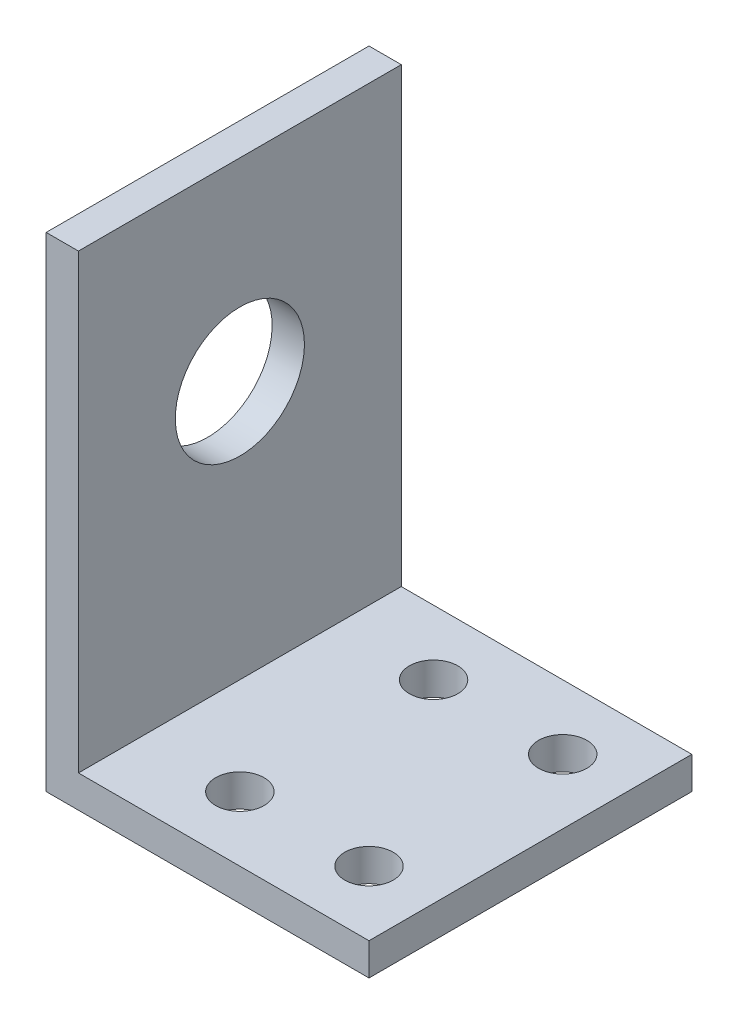
ISO-10303-21;
HEADER;
FILE_DESCRIPTION(('STEP AP214'),'2;1');
FILE_NAME('part.step','',(''),(''),'','','');
FILE_SCHEMA(('AUTOMOTIVE_DESIGN { 1 0 10303 214 1 1 1 1 }'));
ENDSEC;
DATA;
#1=APPLICATION_CONTEXT('core data for automotive mechanical design processes');
#2=APPLICATION_PROTOCOL_DEFINITION('international standard','automotive_design',2000,#1);
#3=PRODUCT_CONTEXT('',#1,'mechanical');
#4=PRODUCT('Part','Part','',(#3));
#5=PRODUCT_RELATED_PRODUCT_CATEGORY('part','',(#4));
#6=PRODUCT_DEFINITION_FORMATION('','',#4);
#7=PRODUCT_DEFINITION_CONTEXT('part definition',#1,'design');
#8=PRODUCT_DEFINITION('design','',#6,#7);
#9=PRODUCT_DEFINITION_SHAPE('','',#8);
#10=(LENGTH_UNIT() NAMED_UNIT(*) SI_UNIT(.MILLI.,.METRE.));
#11=(NAMED_UNIT(*) PLANE_ANGLE_UNIT() SI_UNIT($,.RADIAN.));
#12=(NAMED_UNIT(*) SI_UNIT($,.STERADIAN.) SOLID_ANGLE_UNIT());
#13=UNCERTAINTY_MEASURE_WITH_UNIT(LENGTH_MEASURE(1.E-05),#10,'distance_accuracy_value','');
#14=(GEOMETRIC_REPRESENTATION_CONTEXT(3) GLOBAL_UNCERTAINTY_ASSIGNED_CONTEXT((#13)) GLOBAL_UNIT_ASSIGNED_CONTEXT((#10,
#11,#12)) REPRESENTATION_CONTEXT('',''));
#15=CARTESIAN_POINT('',(0.,0.,0.));
#16=DIRECTION('',(0.,0.,1.));
#17=DIRECTION('',(1.,0.,0.));
#18=AXIS2_PLACEMENT_3D('',#15,#16,#17);
#19=CARTESIAN_POINT('',(20.,3.,20.));
#20=DIRECTION('',(-1.,0.,0.));
#21=DIRECTION('',(0.,-1.,0.));
#22=AXIS2_PLACEMENT_3D('',#19,#20,#21);
#23=PLANE('',#22);
#24=DIRECTION('',(0.,0.,-1.));
#25=VECTOR('',#24,1.);
#26=CARTESIAN_POINT('',(20.,2.,0.));
#27=LINE('',#26,#25);
#28=CARTESIAN_POINT('',(20.,2.,20.));
#29=VERTEX_POINT('',#28);
#30=CARTESIAN_POINT('',(20.,2.,0.));
#31=VERTEX_POINT('',#30);
#32=EDGE_CURVE('E176',#29,#31,#27,.T.);
#33=ORIENTED_EDGE('',*,*,#32,.F.);
#34=DIRECTION('',(0.,1.,0.));
#35=VECTOR('',#34,1.);
#36=CARTESIAN_POINT('',(20.,3.,20.));
#37=LINE('',#36,#35);
#38=CARTESIAN_POINT('',(20.,0.,20.));
#39=VERTEX_POINT('',#38);
#40=EDGE_CURVE('E116',#39,#29,#37,.T.);
#41=ORIENTED_EDGE('',*,*,#40,.F.);
#42=DIRECTION('',(0.,0.,-1.));
#43=VECTOR('',#42,1.);
#44=CARTESIAN_POINT('',(20.,0.,20.));
#45=LINE('',#44,#43);
#46=CARTESIAN_POINT('',(20.,0.,0.));
#47=VERTEX_POINT('',#46);
#48=EDGE_CURVE('E11',#39,#47,#45,.T.);
#49=ORIENTED_EDGE('',*,*,#48,.T.);
#50=DIRECTION('',(0.,1.,0.));
#51=VECTOR('',#50,1.);
#52=CARTESIAN_POINT('',(20.,3.,0.));
#53=LINE('',#52,#51);
#54=EDGE_CURVE('E92',#47,#31,#53,.T.);
#55=ORIENTED_EDGE('',*,*,#54,.T.);
#56=EDGE_LOOP('',(#33,#41,#49,#55));
#57=FACE_BOUND('',#56,.T.);
#58=ADVANCED_FACE('F40',(#57),#23,.F.);
#59=CARTESIAN_POINT('',(16.,0.,16.));
#60=DIRECTION('',(0.,1.,0.));
#61=DIRECTION('',(0.,0.,1.));
#62=AXIS2_PLACEMENT_3D('',#59,#60,#61);
#63=CYLINDRICAL_SURFACE('',#62,1.5);
#64=CARTESIAN_POINT('',(16.,0.,16.));
#65=DIRECTION('',(0.,1.,0.));
#66=DIRECTION('',(0.,0.,1.));
#67=AXIS2_PLACEMENT_3D('',#64,#65,#66);
#68=CIRCLE('',#67,1.5);
#69=CARTESIAN_POINT('',(16.,0.,17.5));
#70=VERTEX_POINT('',#69);
#71=EDGE_CURVE('E104',#70,#70,#68,.T.);
#72=ORIENTED_EDGE('',*,*,#71,.F.);
#73=EDGE_LOOP('',(#72));
#74=FACE_BOUND('',#73,.T.);
#75=CARTESIAN_POINT('',(16.,2.,16.));
#76=DIRECTION('',(0.,1.,0.));
#77=DIRECTION('',(0.,0.,1.));
#78=AXIS2_PLACEMENT_3D('',#75,#76,#77);
#79=CIRCLE('',#78,1.5);
#80=CARTESIAN_POINT('',(16.,2.,17.5));
#81=VERTEX_POINT('',#80);
#82=EDGE_CURVE('E160',#81,#81,#79,.F.);
#83=ORIENTED_EDGE('',*,*,#82,.F.);
#84=EDGE_LOOP('',(#83));
#85=FACE_BOUND('',#84,.T.);
#86=ADVANCED_FACE('F230',(#74,#85),#63,.F.);
#87=CARTESIAN_POINT('',(16.,0.,4.));
#88=DIRECTION('',(0.,1.,0.));
#89=DIRECTION('',(0.,0.,1.));
#90=AXIS2_PLACEMENT_3D('',#87,#88,#89);
#91=CYLINDRICAL_SURFACE('',#90,1.5);
#92=CARTESIAN_POINT('',(16.,0.,4.));
#93=DIRECTION('',(0.,1.,0.));
#94=DIRECTION('',(0.,0.,1.));
#95=AXIS2_PLACEMENT_3D('',#92,#93,#94);
#96=CIRCLE('',#95,1.5);
#97=CARTESIAN_POINT('',(16.,0.,5.5));
#98=VERTEX_POINT('',#97);
#99=EDGE_CURVE('E111',#98,#98,#96,.T.);
#100=ORIENTED_EDGE('',*,*,#99,.F.);
#101=EDGE_LOOP('',(#100));
#102=FACE_BOUND('',#101,.T.);
#103=CARTESIAN_POINT('',(16.,2.,4.));
#104=DIRECTION('',(0.,1.,0.));
#105=DIRECTION('',(0.,0.,1.));
#106=AXIS2_PLACEMENT_3D('',#103,#104,#105);
#107=CIRCLE('',#106,1.5);
#108=CARTESIAN_POINT('',(16.,2.,5.5));
#109=VERTEX_POINT('',#108);
#110=EDGE_CURVE('E164',#109,#109,#107,.F.);
#111=ORIENTED_EDGE('',*,*,#110,.F.);
#112=EDGE_LOOP('',(#111));
#113=FACE_BOUND('',#112,.T.);
#114=ADVANCED_FACE('F234',(#102,#113),#91,.F.);
#115=CARTESIAN_POINT('',(8.00000000000001,-17.,4.));
#116=DIRECTION('',(0.,1.,0.));
#117=DIRECTION('',(0.,0.,1.));
#118=AXIS2_PLACEMENT_3D('',#115,#116,#117);
#119=CYLINDRICAL_SURFACE('',#118,1.5);
#120=CARTESIAN_POINT('',(8.00000000000001,0.,4.));
#121=DIRECTION('',(0.,1.,0.));
#122=DIRECTION('',(0.,0.,1.));
#123=AXIS2_PLACEMENT_3D('',#120,#121,#122);
#124=CIRCLE('',#123,1.5);
#125=CARTESIAN_POINT('',(8.00000000000001,0.,5.5));
#126=VERTEX_POINT('',#125);
#127=EDGE_CURVE('E133',#126,#126,#124,.T.);
#128=ORIENTED_EDGE('',*,*,#127,.F.);
#129=EDGE_LOOP('',(#128));
#130=FACE_BOUND('',#129,.T.);
#131=CARTESIAN_POINT('',(8.00000000000001,1.99999999999999,4.));
#132=DIRECTION('',(0.,1.,0.));
#133=DIRECTION('',(0.,0.,1.));
#134=AXIS2_PLACEMENT_3D('',#131,#132,#133);
#135=CIRCLE('',#134,1.5);
#136=CARTESIAN_POINT('',(8.00000000000001,1.99999999999999,5.5));
#137=VERTEX_POINT('',#136);
#138=EDGE_CURVE('E168',#137,#137,#135,.F.);
#139=ORIENTED_EDGE('',*,*,#138,.F.);
#140=EDGE_LOOP('',(#139));
#141=FACE_BOUND('',#140,.T.);
#142=ADVANCED_FACE('F223',(#130,#141),#119,.F.);
#143=CARTESIAN_POINT('',(8.00000000000001,-17.,16.));
#144=DIRECTION('',(0.,1.,0.));
#145=DIRECTION('',(0.,0.,1.));
#146=AXIS2_PLACEMENT_3D('',#143,#144,#145);
#147=CYLINDRICAL_SURFACE('',#146,1.5);
#148=CARTESIAN_POINT('',(8.00000000000001,0.,16.));
#149=DIRECTION('',(0.,1.,0.));
#150=DIRECTION('',(0.,0.,1.));
#151=AXIS2_PLACEMENT_3D('',#148,#149,#150);
#152=CIRCLE('',#151,1.5);
#153=CARTESIAN_POINT('',(8.00000000000001,0.,17.5));
#154=VERTEX_POINT('',#153);
#155=EDGE_CURVE('E129',#154,#154,#152,.T.);
#156=ORIENTED_EDGE('',*,*,#155,.F.);
#157=EDGE_LOOP('',(#156));
#158=FACE_BOUND('',#157,.T.);
#159=CARTESIAN_POINT('',(8.00000000000001,1.99999999999999,16.));
#160=DIRECTION('',(0.,1.,0.));
#161=DIRECTION('',(0.,0.,1.));
#162=AXIS2_PLACEMENT_3D('',#159,#160,#161);
#163=CIRCLE('',#162,1.5);
#164=CARTESIAN_POINT('',(8.00000000000001,1.99999999999999,17.5));
#165=VERTEX_POINT('',#164);
#166=EDGE_CURVE('E44',#165,#165,#163,.F.);
#167=ORIENTED_EDGE('',*,*,#166,.F.);
#168=EDGE_LOOP('',(#167));
#169=FACE_BOUND('',#168,.T.);
#170=ADVANCED_FACE('F215',(#158,#169),#147,.F.);
#171=CARTESIAN_POINT('',(0.,18.0000000000013,9.99999999999992));
#172=DIRECTION('',(1.,0.,0.));
#173=DIRECTION('',(0.,1.,0.));
#174=AXIS2_PLACEMENT_3D('',#171,#172,#173);
#175=CYLINDRICAL_SURFACE('',#174,3.99999999999949);
#176=CARTESIAN_POINT('',(0.,18.0000000000013,9.99999999999992));
#177=DIRECTION('',(1.,0.,0.));
#178=DIRECTION('',(0.,1.,0.));
#179=AXIS2_PLACEMENT_3D('',#176,#177,#178);
#180=CIRCLE('',#179,3.99999999999949);
#181=CARTESIAN_POINT('',(0.,22.0000000000008,9.99999999999992));
#182=VERTEX_POINT('',#181);
#183=EDGE_CURVE('E125',#182,#182,#180,.T.);
#184=ORIENTED_EDGE('',*,*,#183,.F.);
#185=EDGE_LOOP('',(#184));
#186=FACE_BOUND('',#185,.T.);
#187=CARTESIAN_POINT('',(2.,18.0000000000013,9.99999999999992));
#188=DIRECTION('',(1.,0.,0.));
#189=DIRECTION('',(0.,1.,0.));
#190=AXIS2_PLACEMENT_3D('',#187,#188,#189);
#191=CIRCLE('',#190,3.99999999999949);
#192=CARTESIAN_POINT('',(2.,22.0000000000008,9.99999999999992));
#193=VERTEX_POINT('',#192);
#194=EDGE_CURVE('E147',#193,#193,#191,.F.);
#195=ORIENTED_EDGE('',*,*,#194,.F.);
#196=EDGE_LOOP('',(#195));
#197=FACE_BOUND('',#196,.T.);
#198=ADVANCED_FACE('F213',(#186,#197),#175,.F.);
#199=CARTESIAN_POINT('',(0.,30.,0.));
#200=DIRECTION('',(0.,-1.,0.));
#201=DIRECTION('',(0.,0.,-1.));
#202=AXIS2_PLACEMENT_3D('',#199,#200,#201);
#203=PLANE('',#202);
#204=DIRECTION('',(0.,0.,1.));
#205=VECTOR('',#204,1.);
#206=CARTESIAN_POINT('',(2.,30.,0.));
#207=LINE('',#206,#205);
#208=CARTESIAN_POINT('',(2.,30.,0.));
#209=VERTEX_POINT('',#208);
#210=CARTESIAN_POINT('',(2.,30.,20.));
#211=VERTEX_POINT('',#210);
#212=EDGE_CURVE('E155',#209,#211,#207,.T.);
#213=ORIENTED_EDGE('',*,*,#212,.F.);
#214=DIRECTION('',(-1.,0.,0.));
#215=VECTOR('',#214,1.);
#216=CARTESIAN_POINT('',(3.,30.,0.));
#217=LINE('',#216,#215);
#218=CARTESIAN_POINT('',(0.,30.,0.));
#219=VERTEX_POINT('',#218);
#220=EDGE_CURVE('E143',#209,#219,#217,.T.);
#221=ORIENTED_EDGE('',*,*,#220,.T.);
#222=DIRECTION('',(0.,0.,1.));
#223=VECTOR('',#222,1.);
#224=CARTESIAN_POINT('',(0.,30.,0.));
#225=LINE('',#224,#223);
#226=CARTESIAN_POINT('',(0.,30.,20.));
#227=VERTEX_POINT('',#226);
#228=EDGE_CURVE('E86',#219,#227,#225,.T.);
#229=ORIENTED_EDGE('',*,*,#228,.T.);
#230=DIRECTION('',(1.,0.,0.));
#231=VECTOR('',#230,1.);
#232=CARTESIAN_POINT('',(3.,30.,20.));
#233=LINE('',#232,#231);
#234=EDGE_CURVE('E137',#227,#211,#233,.T.);
#235=ORIENTED_EDGE('',*,*,#234,.T.);
#236=EDGE_LOOP('',(#213,#221,#229,#235));
#237=FACE_BOUND('',#236,.T.);
#238=ADVANCED_FACE('F206',(#237),#203,.F.);
#239=CARTESIAN_POINT('',(20.,0.,20.));
#240=DIRECTION('',(0.,1.,0.));
#241=DIRECTION('',(0.,0.,1.));
#242=AXIS2_PLACEMENT_3D('',#239,#240,#241);
#243=PLANE('',#242);
#244=ORIENTED_EDGE('',*,*,#155,.T.);
#245=EDGE_LOOP('',(#244));
#246=FACE_BOUND('',#245,.T.);
#247=ORIENTED_EDGE('',*,*,#127,.T.);
#248=EDGE_LOOP('',(#247));
#249=FACE_BOUND('',#248,.T.);
#250=ORIENTED_EDGE('',*,*,#99,.T.);
#251=EDGE_LOOP('',(#250));
#252=FACE_BOUND('',#251,.T.);
#253=ORIENTED_EDGE('',*,*,#71,.T.);
#254=EDGE_LOOP('',(#253));
#255=FACE_BOUND('',#254,.T.);
#256=DIRECTION('',(1.,0.,0.));
#257=VECTOR('',#256,1.);
#258=CARTESIAN_POINT('',(20.,0.,0.));
#259=LINE('',#258,#257);
#260=CARTESIAN_POINT('',(0.,0.,0.));
#261=VERTEX_POINT('',#260);
#262=EDGE_CURVE('E97',#261,#47,#259,.T.);
#263=ORIENTED_EDGE('',*,*,#262,.T.);
#264=ORIENTED_EDGE('',*,*,#48,.F.);
#265=DIRECTION('',(1.,0.,0.));
#266=VECTOR('',#265,1.);
#267=CARTESIAN_POINT('',(20.,0.,20.));
#268=LINE('',#267,#266);
#269=CARTESIAN_POINT('',(0.,0.,20.));
#270=VERTEX_POINT('',#269);
#271=EDGE_CURVE('E91',#270,#39,#268,.T.);
#272=ORIENTED_EDGE('',*,*,#271,.F.);
#273=DIRECTION('',(0.,0.,-1.));
#274=VECTOR('',#273,1.);
#275=CARTESIAN_POINT('',(0.,0.,20.));
#276=LINE('',#275,#274);
#277=EDGE_CURVE('E50',#270,#261,#276,.T.);
#278=ORIENTED_EDGE('',*,*,#277,.T.);
#279=EDGE_LOOP('',(#263,#264,#272,#278));
#280=FACE_BOUND('',#279,.T.);
#281=ADVANCED_FACE('F42',(#246,#249,#252,#255,#280),#243,.F.);
#282=CARTESIAN_POINT('',(0.,0.,20.));
#283=DIRECTION('',(1.,0.,0.));
#284=DIRECTION('',(0.,0.,-1.));
#285=AXIS2_PLACEMENT_3D('',#282,#283,#284);
#286=PLANE('',#285);
#287=ORIENTED_EDGE('',*,*,#183,.T.);
#288=EDGE_LOOP('',(#287));
#289=FACE_BOUND('',#288,.T.);
#290=DIRECTION('',(0.,-1.,0.));
#291=VECTOR('',#290,1.);
#292=CARTESIAN_POINT('',(0.,0.,20.));
#293=LINE('',#292,#291);
#294=EDGE_CURVE('E66',#227,#270,#293,.T.);
#295=ORIENTED_EDGE('',*,*,#294,.F.);
#296=ORIENTED_EDGE('',*,*,#228,.F.);
#297=DIRECTION('',(0.,-1.,0.));
#298=VECTOR('',#297,1.);
#299=CARTESIAN_POINT('',(0.,0.,0.));
#300=LINE('',#299,#298);
#301=EDGE_CURVE('E80',#219,#261,#300,.T.);
#302=ORIENTED_EDGE('',*,*,#301,.T.);
#303=ORIENTED_EDGE('',*,*,#277,.F.);
#304=EDGE_LOOP('',(#295,#296,#302,#303));
#305=FACE_BOUND('',#304,.T.);
#306=ADVANCED_FACE('F82',(#289,#305),#286,.F.);
#307=CARTESIAN_POINT('',(0.,0.,20.));
#308=DIRECTION('',(0.,0.,-1.));
#309=DIRECTION('',(-1.,0.,0.));
#310=AXIS2_PLACEMENT_3D('',#307,#308,#309);
#311=PLANE('',#310);
#312=DIRECTION('',(1.,0.,0.));
#313=VECTOR('',#312,1.);
#314=CARTESIAN_POINT('',(2.,2.,20.));
#315=LINE('',#314,#313);
#316=CARTESIAN_POINT('',(2.,2.,20.));
#317=VERTEX_POINT('',#316);
#318=EDGE_CURVE('E180',#317,#29,#315,.T.);
#319=ORIENTED_EDGE('',*,*,#318,.F.);
#320=DIRECTION('',(0.,-1.,0.));
#321=VECTOR('',#320,1.);
#322=CARTESIAN_POINT('',(2.,3.,20.));
#323=LINE('',#322,#321);
#324=EDGE_CURVE('E151',#211,#317,#323,.T.);
#325=ORIENTED_EDGE('',*,*,#324,.F.);
#326=ORIENTED_EDGE('',*,*,#234,.F.);
#327=ORIENTED_EDGE('',*,*,#294,.T.);
#328=ORIENTED_EDGE('',*,*,#271,.T.);
#329=ORIENTED_EDGE('',*,*,#40,.T.);
#330=EDGE_LOOP('',(#319,#325,#326,#327,#328,#329));
#331=FACE_BOUND('',#330,.T.);
#332=ADVANCED_FACE('F196',(#331),#311,.F.);
#333=CARTESIAN_POINT('',(0.,0.,0.));
#334=DIRECTION('',(0.,0.,-1.));
#335=DIRECTION('',(-1.,0.,0.));
#336=AXIS2_PLACEMENT_3D('',#333,#334,#335);
#337=PLANE('',#336);
#338=DIRECTION('',(0.,1.,0.));
#339=VECTOR('',#338,1.);
#340=CARTESIAN_POINT('',(2.,3.,0.));
#341=LINE('',#340,#339);
#342=CARTESIAN_POINT('',(2.,2.,0.));
#343=VERTEX_POINT('',#342);
#344=EDGE_CURVE('E57',#343,#209,#341,.T.);
#345=ORIENTED_EDGE('',*,*,#344,.F.);
#346=DIRECTION('',(-1.,0.,0.));
#347=VECTOR('',#346,1.);
#348=CARTESIAN_POINT('',(2.,2.,0.));
#349=LINE('',#348,#347);
#350=EDGE_CURVE('E172',#31,#343,#349,.T.);
#351=ORIENTED_EDGE('',*,*,#350,.F.);
#352=ORIENTED_EDGE('',*,*,#54,.F.);
#353=ORIENTED_EDGE('',*,*,#262,.F.);
#354=ORIENTED_EDGE('',*,*,#301,.F.);
#355=ORIENTED_EDGE('',*,*,#220,.F.);
#356=EDGE_LOOP('',(#345,#351,#352,#353,#354,#355));
#357=FACE_BOUND('',#356,.T.);
#358=ADVANCED_FACE('F100',(#357),#337,.T.);
#359=CARTESIAN_POINT('',(2.,0.,0.));
#360=DIRECTION('',(1.,0.,0.));
#361=DIRECTION('',(0.,1.,0.));
#362=AXIS2_PLACEMENT_3D('',#359,#360,#361);
#363=PLANE('',#362);
#364=ORIENTED_EDGE('',*,*,#344,.T.);
#365=ORIENTED_EDGE('',*,*,#212,.T.);
#366=ORIENTED_EDGE('',*,*,#324,.T.);
#367=DIRECTION('',(0.,0.,1.));
#368=VECTOR('',#367,1.);
#369=CARTESIAN_POINT('',(2.,2.,0.));
#370=LINE('',#369,#368);
#371=EDGE_CURVE('E183',#343,#317,#370,.T.);
#372=ORIENTED_EDGE('',*,*,#371,.F.);
#373=EDGE_LOOP('',(#364,#365,#366,#372));
#374=FACE_BOUND('',#373,.T.);
#375=ORIENTED_EDGE('',*,*,#194,.T.);
#376=EDGE_LOOP('',(#375));
#377=FACE_BOUND('',#376,.T.);
#378=ADVANCED_FACE('F207',(#374,#377),#363,.T.);
#379=CARTESIAN_POINT('',(0.,2.,0.));
#380=DIRECTION('',(0.,1.,0.));
#381=DIRECTION('',(0.,0.,1.));
#382=AXIS2_PLACEMENT_3D('',#379,#380,#381);
#383=PLANE('',#382);
#384=ORIENTED_EDGE('',*,*,#371,.T.);
#385=ORIENTED_EDGE('',*,*,#318,.T.);
#386=ORIENTED_EDGE('',*,*,#32,.T.);
#387=ORIENTED_EDGE('',*,*,#350,.T.);
#388=EDGE_LOOP('',(#384,#385,#386,#387));
#389=FACE_BOUND('',#388,.T.);
#390=ORIENTED_EDGE('',*,*,#166,.T.);
#391=EDGE_LOOP('',(#390));
#392=FACE_BOUND('',#391,.T.);
#393=ORIENTED_EDGE('',*,*,#138,.T.);
#394=EDGE_LOOP('',(#393));
#395=FACE_BOUND('',#394,.T.);
#396=ORIENTED_EDGE('',*,*,#110,.T.);
#397=EDGE_LOOP('',(#396));
#398=FACE_BOUND('',#397,.T.);
#399=ORIENTED_EDGE('',*,*,#82,.T.);
#400=EDGE_LOOP('',(#399));
#401=FACE_BOUND('',#400,.T.);
#402=ADVANCED_FACE('F189',(#389,#392,#395,#398,#401),#383,.T.);
#403=CLOSED_SHELL('',(#58,#86,#114,#142,#170,#198,#238,#281,#306,#332,#358,#378,#402));
#404=MANIFOLD_SOLID_BREP('B2',#403);
#405=ADVANCED_BREP_SHAPE_REPRESENTATION('',(#18,#404),#14);
#406=SHAPE_DEFINITION_REPRESENTATION(#9,#405);
ENDSEC;
END-ISO-10303-21;
